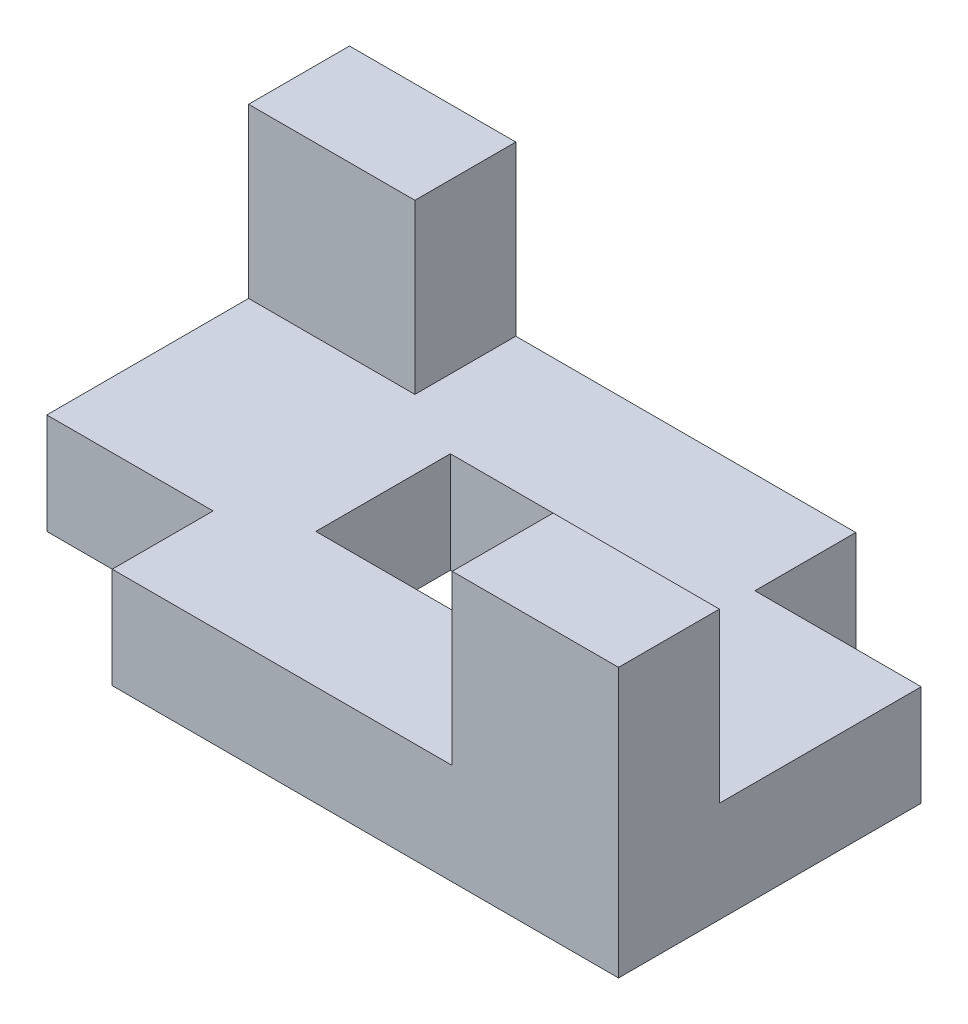
ISO-10303-21;
HEADER;
FILE_DESCRIPTION(('STEP AP214'),'2;1');
FILE_NAME('part.step','',(''),(''),'','','');
FILE_SCHEMA(('AUTOMOTIVE_DESIGN { 1 0 10303 214 1 1 1 1 }'));
ENDSEC;
DATA;
#1=APPLICATION_CONTEXT('core data for automotive mechanical design processes');
#2=APPLICATION_PROTOCOL_DEFINITION('international standard','automotive_design',2000,#1);
#3=PRODUCT_CONTEXT('',#1,'mechanical');
#4=PRODUCT('Part','Part','',(#3));
#5=PRODUCT_RELATED_PRODUCT_CATEGORY('part','',(#4));
#6=PRODUCT_DEFINITION_FORMATION('','',#4);
#7=PRODUCT_DEFINITION_CONTEXT('part definition',#1,'design');
#8=PRODUCT_DEFINITION('design','',#6,#7);
#9=PRODUCT_DEFINITION_SHAPE('','',#8);
#10=(LENGTH_UNIT() NAMED_UNIT(*) SI_UNIT(.MILLI.,.METRE.));
#11=(NAMED_UNIT(*) PLANE_ANGLE_UNIT() SI_UNIT($,.RADIAN.));
#12=(NAMED_UNIT(*) SI_UNIT($,.STERADIAN.) SOLID_ANGLE_UNIT());
#13=UNCERTAINTY_MEASURE_WITH_UNIT(LENGTH_MEASURE(1.E-05),#10,'distance_accuracy_value','');
#14=(GEOMETRIC_REPRESENTATION_CONTEXT(3) GLOBAL_UNCERTAINTY_ASSIGNED_CONTEXT((#13)) GLOBAL_UNIT_ASSIGNED_CONTEXT((#10,
#11,#12)) REPRESENTATION_CONTEXT('',''));
#15=CARTESIAN_POINT('',(0.,0.,0.));
#16=DIRECTION('',(0.,0.,1.));
#17=DIRECTION('',(1.,0.,0.));
#18=AXIS2_PLACEMENT_3D('',#15,#16,#17);
#19=CARTESIAN_POINT('',(0.,15.,0.));
#20=DIRECTION('',(0.,1.,0.));
#21=DIRECTION('',(0.,0.,1.));
#22=AXIS2_PLACEMENT_3D('',#19,#20,#21);
#23=PLANE('',#22);
#24=DIRECTION('',(-1.,0.,0.));
#25=VECTOR('',#24,1.);
#26=CARTESIAN_POINT('',(0.,15.,15.));
#27=LINE('',#26,#25);
#28=CARTESIAN_POINT('',(-25.27352297593,15.,15.));
#29=VERTEX_POINT('',#28);
#30=CARTESIAN_POINT('',(-50.,15.,15.));
#31=VERTEX_POINT('',#30);
#32=EDGE_CURVE('E260',#29,#31,#27,.T.);
#33=ORIENTED_EDGE('',*,*,#32,.F.);
#34=DIRECTION('',(0.,0.,1.));
#35=VECTOR('',#34,1.);
#36=CARTESIAN_POINT('',(-25.27352297593,15.,0.));
#37=LINE('',#36,#35);
#38=CARTESIAN_POINT('',(-25.27352297593,15.,30.));
#39=VERTEX_POINT('',#38);
#40=EDGE_CURVE('E263',#29,#39,#37,.T.);
#41=ORIENTED_EDGE('',*,*,#40,.T.);
#42=DIRECTION('',(1.,0.,0.));
#43=VECTOR('',#42,1.);
#44=CARTESIAN_POINT('',(0.,15.,30.));
#45=LINE('',#44,#43);
#46=CARTESIAN_POINT('',(25.27352297593,15.,30.));
#47=VERTEX_POINT('',#46);
#48=EDGE_CURVE('E347',#39,#47,#45,.T.);
#49=ORIENTED_EDGE('',*,*,#48,.T.);
#50=DIRECTION('',(0.,0.,1.));
#51=VECTOR('',#50,1.);
#52=CARTESIAN_POINT('',(25.27352297593,15.,0.));
#53=LINE('',#52,#51);
#54=CARTESIAN_POINT('',(25.27352297593,15.,15.));
#55=VERTEX_POINT('',#54);
#56=EDGE_CURVE('E293',#55,#47,#53,.T.);
#57=ORIENTED_EDGE('',*,*,#56,.F.);
#58=DIRECTION('',(1.,0.,0.));
#59=VECTOR('',#58,1.);
#60=CARTESIAN_POINT('',(0.,15.,15.));
#61=LINE('',#60,#59);
#62=CARTESIAN_POINT('',(50.,15.,15.));
#63=VERTEX_POINT('',#62);
#64=EDGE_CURVE('E297',#55,#63,#61,.T.);
#65=ORIENTED_EDGE('',*,*,#64,.T.);
#66=DIRECTION('',(0.,0.,1.));
#67=VECTOR('',#66,1.);
#68=CARTESIAN_POINT('',(50.,15.,0.));
#69=LINE('',#68,#67);
#70=CARTESIAN_POINT('',(50.,15.,-15.));
#71=VERTEX_POINT('',#70);
#72=EDGE_CURVE('E335',#71,#63,#69,.T.);
#73=ORIENTED_EDGE('',*,*,#72,.F.);
#74=DIRECTION('',(1.,0.,0.));
#75=VECTOR('',#74,1.);
#76=CARTESIAN_POINT('',(0.,15.,-15.));
#77=LINE('',#76,#75);
#78=CARTESIAN_POINT('',(25.27352297593,15.,-15.));
#79=VERTEX_POINT('',#78);
#80=EDGE_CURVE('E237',#79,#71,#77,.T.);
#81=ORIENTED_EDGE('',*,*,#80,.F.);
#82=DIRECTION('',(0.,0.,-1.));
#83=VECTOR('',#82,1.);
#84=CARTESIAN_POINT('',(25.27352297593,15.,0.));
#85=LINE('',#84,#83);
#86=CARTESIAN_POINT('',(25.27352297593,15.,-30.));
#87=VERTEX_POINT('',#86);
#88=EDGE_CURVE('E256',#79,#87,#85,.T.);
#89=ORIENTED_EDGE('',*,*,#88,.T.);
#90=DIRECTION('',(1.,0.,0.));
#91=VECTOR('',#90,1.);
#92=CARTESIAN_POINT('',(0.,15.,-30.));
#93=LINE('',#92,#91);
#94=CARTESIAN_POINT('',(-25.27352297593,15.,-30.));
#95=VERTEX_POINT('',#94);
#96=EDGE_CURVE('E338',#95,#87,#93,.T.);
#97=ORIENTED_EDGE('',*,*,#96,.F.);
#98=DIRECTION('',(0.,0.,-1.));
#99=VECTOR('',#98,1.);
#100=CARTESIAN_POINT('',(-25.27352297593,15.,0.));
#101=LINE('',#100,#99);
#102=CARTESIAN_POINT('',(-25.27352297593,15.,-15.));
#103=VERTEX_POINT('',#102);
#104=EDGE_CURVE('E320',#103,#95,#101,.T.);
#105=ORIENTED_EDGE('',*,*,#104,.F.);
#106=DIRECTION('',(-1.,0.,0.));
#107=VECTOR('',#106,1.);
#108=CARTESIAN_POINT('',(0.,15.,-15.));
#109=LINE('',#108,#107);
#110=CARTESIAN_POINT('',(-50.,15.,-15.));
#111=VERTEX_POINT('',#110);
#112=EDGE_CURVE('E331',#103,#111,#109,.T.);
#113=ORIENTED_EDGE('',*,*,#112,.T.);
#114=DIRECTION('',(0.,0.,1.));
#115=VECTOR('',#114,1.);
#116=CARTESIAN_POINT('',(-50.,15.,0.));
#117=LINE('',#116,#115);
#118=EDGE_CURVE('E343',#111,#31,#117,.T.);
#119=ORIENTED_EDGE('',*,*,#118,.T.);
#120=EDGE_LOOP('',(#33,#41,#49,#57,#65,#73,#81,#89,#97,#105,#113,#119));
#121=FACE_BOUND('',#120,.T.);
#122=DIRECTION('',(-1.,0.,0.));
#123=VECTOR('',#122,1.);
#124=CARTESIAN_POINT('',(0.,15.,10.));
#125=LINE('',#124,#123);
#126=CARTESIAN_POINT('',(15.,15.,10.));
#127=VERTEX_POINT('',#126);
#128=CARTESIAN_POINT('',(-15.,15.,10.));
#129=VERTEX_POINT('',#128);
#130=EDGE_CURVE('E212',#127,#129,#125,.T.);
#131=ORIENTED_EDGE('',*,*,#130,.T.);
#132=DIRECTION('',(0.,0.,-1.));
#133=VECTOR('',#132,1.);
#134=CARTESIAN_POINT('',(-15.,15.,0.));
#135=LINE('',#134,#133);
#136=CARTESIAN_POINT('',(-15.,15.,-10.));
#137=VERTEX_POINT('',#136);
#138=EDGE_CURVE('E173',#129,#137,#135,.T.);
#139=ORIENTED_EDGE('',*,*,#138,.T.);
#140=DIRECTION('',(-1.,0.,0.));
#141=VECTOR('',#140,1.);
#142=CARTESIAN_POINT('',(0.,15.,-10.));
#143=LINE('',#142,#141);
#144=CARTESIAN_POINT('',(15.,15.,-10.));
#145=VERTEX_POINT('',#144);
#146=EDGE_CURVE('E177',#145,#137,#143,.T.);
#147=ORIENTED_EDGE('',*,*,#146,.F.);
#148=DIRECTION('',(0.,0.,-1.));
#149=VECTOR('',#148,1.);
#150=CARTESIAN_POINT('',(15.,15.,0.));
#151=LINE('',#150,#149);
#152=EDGE_CURVE('E209',#127,#145,#151,.T.);
#153=ORIENTED_EDGE('',*,*,#152,.F.);
#154=EDGE_LOOP('',(#131,#139,#147,#153));
#155=FACE_BOUND('',#154,.T.);
#156=ADVANCED_FACE('F45',(#121,#155),#23,.T.);
#157=CARTESIAN_POINT('',(0.,0.,0.));
#158=DIRECTION('',(0.,1.,0.));
#159=DIRECTION('',(0.,0.,1.));
#160=AXIS2_PLACEMENT_3D('',#157,#158,#159);
#161=PLANE('',#160);
#162=DIRECTION('',(0.,0.,-1.));
#163=VECTOR('',#162,1.);
#164=CARTESIAN_POINT('',(-25.27352297593,0.,0.));
#165=LINE('',#164,#163);
#166=CARTESIAN_POINT('',(-25.27352297593,0.,30.));
#167=VERTEX_POINT('',#166);
#168=CARTESIAN_POINT('',(-25.27352297593,0.,15.));
#169=VERTEX_POINT('',#168);
#170=EDGE_CURVE('E218',#167,#169,#165,.T.);
#171=ORIENTED_EDGE('',*,*,#170,.T.);
#172=DIRECTION('',(1.,0.,0.));
#173=VECTOR('',#172,1.);
#174=CARTESIAN_POINT('',(0.,0.,15.));
#175=LINE('',#174,#173);
#176=CARTESIAN_POINT('',(-50.,0.,15.));
#177=VERTEX_POINT('',#176);
#178=EDGE_CURVE('E222',#177,#169,#175,.T.);
#179=ORIENTED_EDGE('',*,*,#178,.F.);
#180=DIRECTION('',(0.,0.,1.));
#181=VECTOR('',#180,1.);
#182=CARTESIAN_POINT('',(-50.,0.,0.));
#183=LINE('',#182,#181);
#184=CARTESIAN_POINT('',(-50.,0.,-30.));
#185=VERTEX_POINT('',#184);
#186=EDGE_CURVE('E357',#185,#177,#183,.T.);
#187=ORIENTED_EDGE('',*,*,#186,.F.);
#188=DIRECTION('',(1.,0.,0.));
#189=VECTOR('',#188,1.);
#190=CARTESIAN_POINT('',(0.,0.,-30.));
#191=LINE('',#190,#189);
#192=CARTESIAN_POINT('',(25.27352297593,0.,-30.));
#193=VERTEX_POINT('',#192);
#194=EDGE_CURVE('E353',#185,#193,#191,.T.);
#195=ORIENTED_EDGE('',*,*,#194,.T.);
#196=DIRECTION('',(0.,0.,1.));
#197=VECTOR('',#196,1.);
#198=CARTESIAN_POINT('',(25.27352297593,0.,0.));
#199=LINE('',#198,#197);
#200=CARTESIAN_POINT('',(25.27352297593,0.,-15.));
#201=VERTEX_POINT('',#200);
#202=EDGE_CURVE('E217',#193,#201,#199,.T.);
#203=ORIENTED_EDGE('',*,*,#202,.T.);
#204=DIRECTION('',(-1.,0.,0.));
#205=VECTOR('',#204,1.);
#206=CARTESIAN_POINT('',(0.,0.,-15.));
#207=LINE('',#206,#205);
#208=CARTESIAN_POINT('',(50.,0.,-15.));
#209=VERTEX_POINT('',#208);
#210=EDGE_CURVE('E241',#209,#201,#207,.T.);
#211=ORIENTED_EDGE('',*,*,#210,.F.);
#212=DIRECTION('',(0.,0.,1.));
#213=VECTOR('',#212,1.);
#214=CARTESIAN_POINT('',(50.,0.,0.));
#215=LINE('',#214,#213);
#216=CARTESIAN_POINT('',(50.,0.,30.));
#217=VERTEX_POINT('',#216);
#218=EDGE_CURVE('E334',#209,#217,#215,.T.);
#219=ORIENTED_EDGE('',*,*,#218,.T.);
#220=DIRECTION('',(1.,0.,0.));
#221=VECTOR('',#220,1.);
#222=CARTESIAN_POINT('',(0.,0.,30.));
#223=LINE('',#222,#221);
#224=EDGE_CURVE('E339',#167,#217,#223,.T.);
#225=ORIENTED_EDGE('',*,*,#224,.F.);
#226=EDGE_LOOP('',(#171,#179,#187,#195,#203,#211,#219,#225));
#227=FACE_BOUND('',#226,.T.);
#228=DIRECTION('',(0.,0.,1.));
#229=VECTOR('',#228,1.);
#230=CARTESIAN_POINT('',(-15.,0.,-10.));
#231=LINE('',#230,#229);
#232=CARTESIAN_POINT('',(-15.,0.,-10.));
#233=VERTEX_POINT('',#232);
#234=CARTESIAN_POINT('',(-15.,0.,10.));
#235=VERTEX_POINT('',#234);
#236=EDGE_CURVE('E69',#233,#235,#231,.T.);
#237=ORIENTED_EDGE('',*,*,#236,.T.);
#238=DIRECTION('',(1.,0.,0.));
#239=VECTOR('',#238,1.);
#240=CARTESIAN_POINT('',(-15.,0.,10.));
#241=LINE('',#240,#239);
#242=CARTESIAN_POINT('',(15.,0.,10.));
#243=VERTEX_POINT('',#242);
#244=EDGE_CURVE('E181',#235,#243,#241,.T.);
#245=ORIENTED_EDGE('',*,*,#244,.T.);
#246=DIRECTION('',(0.,0.,1.));
#247=VECTOR('',#246,1.);
#248=CARTESIAN_POINT('',(15.,0.,-10.));
#249=LINE('',#248,#247);
#250=CARTESIAN_POINT('',(15.,0.,-10.));
#251=VERTEX_POINT('',#250);
#252=EDGE_CURVE('E188',#251,#243,#249,.T.);
#253=ORIENTED_EDGE('',*,*,#252,.F.);
#254=DIRECTION('',(1.,0.,0.));
#255=VECTOR('',#254,1.);
#256=CARTESIAN_POINT('',(-15.,0.,-10.));
#257=LINE('',#256,#255);
#258=EDGE_CURVE('E192',#233,#251,#257,.T.);
#259=ORIENTED_EDGE('',*,*,#258,.F.);
#260=EDGE_LOOP('',(#237,#245,#253,#259));
#261=FACE_BOUND('',#260,.T.);
#262=ADVANCED_FACE('F191',(#227,#261),#161,.F.);
#263=CARTESIAN_POINT('',(0.,15.,-30.));
#264=DIRECTION('',(0.,0.,-1.));
#265=DIRECTION('',(-1.,0.,0.));
#266=AXIS2_PLACEMENT_3D('',#263,#264,#265);
#267=PLANE('',#266);
#268=ORIENTED_EDGE('',*,*,#96,.T.);
#269=DIRECTION('',(0.,-1.,0.));
#270=VECTOR('',#269,1.);
#271=CARTESIAN_POINT('',(25.27352297593,40.,-30.));
#272=LINE('',#271,#270);
#273=EDGE_CURVE('E223',#87,#193,#272,.T.);
#274=ORIENTED_EDGE('',*,*,#273,.T.);
#275=ORIENTED_EDGE('',*,*,#194,.F.);
#276=DIRECTION('',(0.,-1.,0.));
#277=VECTOR('',#276,1.);
#278=CARTESIAN_POINT('',(-50.,15.,-30.));
#279=LINE('',#278,#277);
#280=CARTESIAN_POINT('',(-50.,40.,-30.));
#281=VERTEX_POINT('',#280);
#282=EDGE_CURVE('E11',#281,#185,#279,.T.);
#283=ORIENTED_EDGE('',*,*,#282,.F.);
#284=DIRECTION('',(1.,0.,0.));
#285=VECTOR('',#284,1.);
#286=CARTESIAN_POINT('',(-50.,40.,-30.));
#287=LINE('',#286,#285);
#288=CARTESIAN_POINT('',(-25.27352297593,40.,-30.));
#289=VERTEX_POINT('',#288);
#290=EDGE_CURVE('E301',#281,#289,#287,.T.);
#291=ORIENTED_EDGE('',*,*,#290,.T.);
#292=DIRECTION('',(0.,-1.,0.));
#293=VECTOR('',#292,1.);
#294=CARTESIAN_POINT('',(-25.27352297593,40.,-30.));
#295=LINE('',#294,#293);
#296=EDGE_CURVE('E315',#289,#95,#295,.T.);
#297=ORIENTED_EDGE('',*,*,#296,.T.);
#298=EDGE_LOOP('',(#268,#274,#275,#283,#291,#297));
#299=FACE_BOUND('',#298,.T.);
#300=ADVANCED_FACE('F410',(#299),#267,.T.);
#301=CARTESIAN_POINT('',(0.,15.,30.));
#302=DIRECTION('',(0.,0.,-1.));
#303=DIRECTION('',(-1.,0.,0.));
#304=AXIS2_PLACEMENT_3D('',#301,#302,#303);
#305=PLANE('',#304);
#306=DIRECTION('',(0.,-1.,0.));
#307=VECTOR('',#306,1.);
#308=CARTESIAN_POINT('',(-25.27352297593,40.,30.));
#309=LINE('',#308,#307);
#310=EDGE_CURVE('E233',#39,#167,#309,.T.);
#311=ORIENTED_EDGE('',*,*,#310,.T.);
#312=ORIENTED_EDGE('',*,*,#224,.T.);
#313=DIRECTION('',(0.,-1.,0.));
#314=VECTOR('',#313,1.);
#315=CARTESIAN_POINT('',(50.,15.,30.));
#316=LINE('',#315,#314);
#317=CARTESIAN_POINT('',(50.,40.,30.));
#318=VERTEX_POINT('',#317);
#319=EDGE_CURVE('E54',#318,#217,#316,.T.);
#320=ORIENTED_EDGE('',*,*,#319,.F.);
#321=DIRECTION('',(-1.,0.,0.));
#322=VECTOR('',#321,1.);
#323=CARTESIAN_POINT('',(50.,40.,30.));
#324=LINE('',#323,#322);
#325=CARTESIAN_POINT('',(25.27352297593,40.,30.));
#326=VERTEX_POINT('',#325);
#327=EDGE_CURVE('E289',#318,#326,#324,.T.);
#328=ORIENTED_EDGE('',*,*,#327,.T.);
#329=DIRECTION('',(0.,-1.,0.));
#330=VECTOR('',#329,1.);
#331=CARTESIAN_POINT('',(25.27352297593,40.,30.));
#332=LINE('',#331,#330);
#333=EDGE_CURVE('E268',#326,#47,#332,.T.);
#334=ORIENTED_EDGE('',*,*,#333,.T.);
#335=ORIENTED_EDGE('',*,*,#48,.F.);
#336=EDGE_LOOP('',(#311,#312,#320,#328,#334,#335));
#337=FACE_BOUND('',#336,.T.);
#338=ADVANCED_FACE('F371',(#337),#305,.F.);
#339=CARTESIAN_POINT('',(50.,15.,0.));
#340=DIRECTION('',(1.,0.,0.));
#341=DIRECTION('',(0.,0.,-1.));
#342=AXIS2_PLACEMENT_3D('',#339,#340,#341);
#343=PLANE('',#342);
#344=DIRECTION('',(0.,-1.,0.));
#345=VECTOR('',#344,1.);
#346=CARTESIAN_POINT('',(50.,40.,-15.));
#347=LINE('',#346,#345);
#348=EDGE_CURVE('E245',#71,#209,#347,.T.);
#349=ORIENTED_EDGE('',*,*,#348,.F.);
#350=ORIENTED_EDGE('',*,*,#72,.T.);
#351=DIRECTION('',(0.,-1.,0.));
#352=VECTOR('',#351,1.);
#353=CARTESIAN_POINT('',(50.,40.,15.));
#354=LINE('',#353,#352);
#355=CARTESIAN_POINT('',(50.,40.,15.));
#356=VERTEX_POINT('',#355);
#357=EDGE_CURVE('E267',#356,#63,#354,.T.);
#358=ORIENTED_EDGE('',*,*,#357,.F.);
#359=DIRECTION('',(0.,0.,-1.));
#360=VECTOR('',#359,1.);
#361=CARTESIAN_POINT('',(50.,40.,30.));
#362=LINE('',#361,#360);
#363=EDGE_CURVE('E272',#318,#356,#362,.T.);
#364=ORIENTED_EDGE('',*,*,#363,.F.);
#365=ORIENTED_EDGE('',*,*,#319,.T.);
#366=ORIENTED_EDGE('',*,*,#218,.F.);
#367=EDGE_LOOP('',(#349,#350,#358,#364,#365,#366));
#368=FACE_BOUND('',#367,.T.);
#369=ADVANCED_FACE('F47',(#368),#343,.T.);
#370=CARTESIAN_POINT('',(-50.,15.,0.));
#371=DIRECTION('',(1.,0.,0.));
#372=DIRECTION('',(0.,0.,-1.));
#373=AXIS2_PLACEMENT_3D('',#370,#371,#372);
#374=PLANE('',#373);
#375=ORIENTED_EDGE('',*,*,#186,.T.);
#376=DIRECTION('',(0.,-1.,0.));
#377=VECTOR('',#376,1.);
#378=CARTESIAN_POINT('',(-50.,40.,15.));
#379=LINE('',#378,#377);
#380=EDGE_CURVE('E227',#31,#177,#379,.T.);
#381=ORIENTED_EDGE('',*,*,#380,.F.);
#382=ORIENTED_EDGE('',*,*,#118,.F.);
#383=DIRECTION('',(0.,-1.,0.));
#384=VECTOR('',#383,1.);
#385=CARTESIAN_POINT('',(-50.,40.,-15.));
#386=LINE('',#385,#384);
#387=CARTESIAN_POINT('',(-50.,40.,-15.));
#388=VERTEX_POINT('',#387);
#389=EDGE_CURVE('E316',#388,#111,#386,.T.);
#390=ORIENTED_EDGE('',*,*,#389,.F.);
#391=DIRECTION('',(0.,0.,1.));
#392=VECTOR('',#391,1.);
#393=CARTESIAN_POINT('',(-50.,40.,-30.));
#394=LINE('',#393,#392);
#395=EDGE_CURVE('E312',#281,#388,#394,.T.);
#396=ORIENTED_EDGE('',*,*,#395,.F.);
#397=ORIENTED_EDGE('',*,*,#282,.T.);
#398=EDGE_LOOP('',(#375,#381,#382,#390,#396,#397));
#399=FACE_BOUND('',#398,.T.);
#400=ADVANCED_FACE('F404',(#399),#374,.F.);
#401=CARTESIAN_POINT('',(-50.,40.,-15.));
#402=DIRECTION('',(0.,0.,-1.));
#403=DIRECTION('',(-1.,0.,0.));
#404=AXIS2_PLACEMENT_3D('',#401,#402,#403);
#405=PLANE('',#404);
#406=ORIENTED_EDGE('',*,*,#112,.F.);
#407=DIRECTION('',(0.,-1.,0.));
#408=VECTOR('',#407,1.);
#409=CARTESIAN_POINT('',(-25.27352297593,40.,-15.));
#410=LINE('',#409,#408);
#411=CARTESIAN_POINT('',(-25.27352297593,40.,-15.));
#412=VERTEX_POINT('',#411);
#413=EDGE_CURVE('E321',#412,#103,#410,.T.);
#414=ORIENTED_EDGE('',*,*,#413,.F.);
#415=DIRECTION('',(1.,0.,0.));
#416=VECTOR('',#415,1.);
#417=CARTESIAN_POINT('',(-50.,40.,-15.));
#418=LINE('',#417,#416);
#419=EDGE_CURVE('E309',#388,#412,#418,.T.);
#420=ORIENTED_EDGE('',*,*,#419,.F.);
#421=ORIENTED_EDGE('',*,*,#389,.T.);
#422=EDGE_LOOP('',(#406,#414,#420,#421));
#423=FACE_BOUND('',#422,.T.);
#424=ADVANCED_FACE('F420',(#423),#405,.F.);
#425=CARTESIAN_POINT('',(-25.27352297593,40.,-30.));
#426=DIRECTION('',(1.,0.,0.));
#427=DIRECTION('',(0.,0.,-1.));
#428=AXIS2_PLACEMENT_3D('',#425,#426,#427);
#429=PLANE('',#428);
#430=ORIENTED_EDGE('',*,*,#413,.T.);
#431=ORIENTED_EDGE('',*,*,#104,.T.);
#432=ORIENTED_EDGE('',*,*,#296,.F.);
#433=DIRECTION('',(0.,0.,1.));
#434=VECTOR('',#433,1.);
#435=CARTESIAN_POINT('',(-25.27352297593,40.,-30.));
#436=LINE('',#435,#434);
#437=EDGE_CURVE('E305',#289,#412,#436,.T.);
#438=ORIENTED_EDGE('',*,*,#437,.T.);
#439=EDGE_LOOP('',(#430,#431,#432,#438));
#440=FACE_BOUND('',#439,.T.);
#441=ADVANCED_FACE('F415',(#440),#429,.T.);
#442=CARTESIAN_POINT('',(0.,40.,0.));
#443=DIRECTION('',(0.,-1.,0.));
#444=DIRECTION('',(0.,0.,-1.));
#445=AXIS2_PLACEMENT_3D('',#442,#443,#444);
#446=PLANE('',#445);
#447=ORIENTED_EDGE('',*,*,#290,.F.);
#448=ORIENTED_EDGE('',*,*,#395,.T.);
#449=ORIENTED_EDGE('',*,*,#419,.T.);
#450=ORIENTED_EDGE('',*,*,#437,.F.);
#451=EDGE_LOOP('',(#447,#448,#449,#450));
#452=FACE_BOUND('',#451,.T.);
#453=ADVANCED_FACE('F422',(#452),#446,.F.);
#454=CARTESIAN_POINT('',(50.,40.,15.));
#455=DIRECTION('',(0.,0.,1.));
#456=DIRECTION('',(1.,0.,0.));
#457=AXIS2_PLACEMENT_3D('',#454,#455,#456);
#458=PLANE('',#457);
#459=ORIENTED_EDGE('',*,*,#64,.F.);
#460=DIRECTION('',(0.,-1.,0.));
#461=VECTOR('',#460,1.);
#462=CARTESIAN_POINT('',(25.27352297593,40.,15.));
#463=LINE('',#462,#461);
#464=CARTESIAN_POINT('',(25.27352297593,40.,15.));
#465=VERTEX_POINT('',#464);
#466=EDGE_CURVE('E273',#465,#55,#463,.T.);
#467=ORIENTED_EDGE('',*,*,#466,.F.);
#468=DIRECTION('',(-1.,0.,0.));
#469=VECTOR('',#468,1.);
#470=CARTESIAN_POINT('',(50.,40.,15.));
#471=LINE('',#470,#469);
#472=EDGE_CURVE('E282',#356,#465,#471,.T.);
#473=ORIENTED_EDGE('',*,*,#472,.F.);
#474=ORIENTED_EDGE('',*,*,#357,.T.);
#475=EDGE_LOOP('',(#459,#467,#473,#474));
#476=FACE_BOUND('',#475,.T.);
#477=ADVANCED_FACE('F388',(#476),#458,.F.);
#478=CARTESIAN_POINT('',(25.27352297593,40.,30.));
#479=DIRECTION('',(-1.,0.,0.));
#480=DIRECTION('',(0.,0.,1.));
#481=AXIS2_PLACEMENT_3D('',#478,#479,#480);
#482=PLANE('',#481);
#483=ORIENTED_EDGE('',*,*,#466,.T.);
#484=ORIENTED_EDGE('',*,*,#56,.T.);
#485=ORIENTED_EDGE('',*,*,#333,.F.);
#486=DIRECTION('',(0.,0.,-1.));
#487=VECTOR('',#486,1.);
#488=CARTESIAN_POINT('',(25.27352297593,40.,30.));
#489=LINE('',#488,#487);
#490=EDGE_CURVE('E285',#326,#465,#489,.T.);
#491=ORIENTED_EDGE('',*,*,#490,.T.);
#492=EDGE_LOOP('',(#483,#484,#485,#491));
#493=FACE_BOUND('',#492,.T.);
#494=ADVANCED_FACE('F393',(#493),#482,.T.);
#495=CARTESIAN_POINT('',(0.,40.,0.));
#496=DIRECTION('',(0.,-1.,0.));
#497=DIRECTION('',(0.,0.,-1.));
#498=AXIS2_PLACEMENT_3D('',#495,#496,#497);
#499=PLANE('',#498);
#500=ORIENTED_EDGE('',*,*,#327,.F.);
#501=ORIENTED_EDGE('',*,*,#363,.T.);
#502=ORIENTED_EDGE('',*,*,#472,.T.);
#503=ORIENTED_EDGE('',*,*,#490,.F.);
#504=EDGE_LOOP('',(#500,#501,#502,#503));
#505=FACE_BOUND('',#504,.T.);
#506=ADVANCED_FACE('F391',(#505),#499,.F.);
#507=CARTESIAN_POINT('',(25.27352297593,40.,0.));
#508=DIRECTION('',(1.,0.,0.));
#509=DIRECTION('',(0.,0.,-1.));
#510=AXIS2_PLACEMENT_3D('',#507,#508,#509);
#511=PLANE('',#510);
#512=DIRECTION('',(0.,-1.,0.));
#513=VECTOR('',#512,1.);
#514=CARTESIAN_POINT('',(25.27352297593,40.,-15.));
#515=LINE('',#514,#513);
#516=EDGE_CURVE('E248',#79,#201,#515,.T.);
#517=ORIENTED_EDGE('',*,*,#516,.T.);
#518=ORIENTED_EDGE('',*,*,#202,.F.);
#519=ORIENTED_EDGE('',*,*,#273,.F.);
#520=ORIENTED_EDGE('',*,*,#88,.F.);
#521=EDGE_LOOP('',(#517,#518,#519,#520));
#522=FACE_BOUND('',#521,.T.);
#523=ADVANCED_FACE('F412',(#522),#511,.T.);
#524=CARTESIAN_POINT('',(0.,40.,-15.));
#525=DIRECTION('',(0.,0.,1.));
#526=DIRECTION('',(1.,0.,0.));
#527=AXIS2_PLACEMENT_3D('',#524,#525,#526);
#528=PLANE('',#527);
#529=ORIENTED_EDGE('',*,*,#80,.T.);
#530=ORIENTED_EDGE('',*,*,#348,.T.);
#531=ORIENTED_EDGE('',*,*,#210,.T.);
#532=ORIENTED_EDGE('',*,*,#516,.F.);
#533=EDGE_LOOP('',(#529,#530,#531,#532));
#534=FACE_BOUND('',#533,.T.);
#535=ADVANCED_FACE('F378',(#534),#528,.F.);
#536=CARTESIAN_POINT('',(-25.27352297593,40.,0.));
#537=DIRECTION('',(-1.,0.,0.));
#538=DIRECTION('',(0.,0.,1.));
#539=AXIS2_PLACEMENT_3D('',#536,#537,#538);
#540=PLANE('',#539);
#541=DIRECTION('',(0.,-1.,0.));
#542=VECTOR('',#541,1.);
#543=CARTESIAN_POINT('',(-25.27352297593,40.,15.));
#544=LINE('',#543,#542);
#545=EDGE_CURVE('E230',#29,#169,#544,.T.);
#546=ORIENTED_EDGE('',*,*,#545,.T.);
#547=ORIENTED_EDGE('',*,*,#170,.F.);
#548=ORIENTED_EDGE('',*,*,#310,.F.);
#549=ORIENTED_EDGE('',*,*,#40,.F.);
#550=EDGE_LOOP('',(#546,#547,#548,#549));
#551=FACE_BOUND('',#550,.T.);
#552=ADVANCED_FACE('F396',(#551),#540,.T.);
#553=CARTESIAN_POINT('',(0.,40.,15.));
#554=DIRECTION('',(0.,0.,-1.));
#555=DIRECTION('',(-1.,0.,0.));
#556=AXIS2_PLACEMENT_3D('',#553,#554,#555);
#557=PLANE('',#556);
#558=ORIENTED_EDGE('',*,*,#32,.T.);
#559=ORIENTED_EDGE('',*,*,#380,.T.);
#560=ORIENTED_EDGE('',*,*,#178,.T.);
#561=ORIENTED_EDGE('',*,*,#545,.F.);
#562=EDGE_LOOP('',(#558,#559,#560,#561));
#563=FACE_BOUND('',#562,.T.);
#564=ADVANCED_FACE('F398',(#563),#557,.F.);
#565=CARTESIAN_POINT('',(-15.,40.,-10.));
#566=DIRECTION('',(1.,0.,0.));
#567=DIRECTION('',(0.,0.,-1.));
#568=AXIS2_PLACEMENT_3D('',#565,#566,#567);
#569=PLANE('',#568);
#570=DIRECTION('',(0.,-1.,0.));
#571=VECTOR('',#570,1.);
#572=CARTESIAN_POINT('',(-15.,40.,10.));
#573=LINE('',#572,#571);
#574=EDGE_CURVE('E169',#129,#235,#573,.T.);
#575=ORIENTED_EDGE('',*,*,#574,.T.);
#576=ORIENTED_EDGE('',*,*,#236,.F.);
#577=DIRECTION('',(0.,-1.,0.));
#578=VECTOR('',#577,1.);
#579=CARTESIAN_POINT('',(-15.,40.,-10.));
#580=LINE('',#579,#578);
#581=EDGE_CURVE('E200',#137,#233,#580,.T.);
#582=ORIENTED_EDGE('',*,*,#581,.F.);
#583=ORIENTED_EDGE('',*,*,#138,.F.);
#584=EDGE_LOOP('',(#575,#576,#582,#583));
#585=FACE_BOUND('',#584,.T.);
#586=ADVANCED_FACE('F171',(#585),#569,.T.);
#587=CARTESIAN_POINT('',(-15.,40.,10.));
#588=DIRECTION('',(0.,0.,-1.));
#589=DIRECTION('',(-1.,0.,0.));
#590=AXIS2_PLACEMENT_3D('',#587,#588,#589);
#591=PLANE('',#590);
#592=DIRECTION('',(0.,-1.,0.));
#593=VECTOR('',#592,1.);
#594=CARTESIAN_POINT('',(15.,40.,10.));
#595=LINE('',#594,#593);
#596=EDGE_CURVE('E178',#127,#243,#595,.T.);
#597=ORIENTED_EDGE('',*,*,#596,.T.);
#598=ORIENTED_EDGE('',*,*,#244,.F.);
#599=ORIENTED_EDGE('',*,*,#574,.F.);
#600=ORIENTED_EDGE('',*,*,#130,.F.);
#601=EDGE_LOOP('',(#597,#598,#599,#600));
#602=FACE_BOUND('',#601,.T.);
#603=ADVANCED_FACE('F182',(#602),#591,.T.);
#604=CARTESIAN_POINT('',(15.,40.,-10.));
#605=DIRECTION('',(1.,0.,0.));
#606=DIRECTION('',(0.,0.,-1.));
#607=AXIS2_PLACEMENT_3D('',#604,#605,#606);
#608=PLANE('',#607);
#609=ORIENTED_EDGE('',*,*,#152,.T.);
#610=DIRECTION('',(0.,-1.,0.));
#611=VECTOR('',#610,1.);
#612=CARTESIAN_POINT('',(15.,40.,-10.));
#613=LINE('',#612,#611);
#614=EDGE_CURVE('E61',#145,#251,#613,.T.);
#615=ORIENTED_EDGE('',*,*,#614,.T.);
#616=ORIENTED_EDGE('',*,*,#252,.T.);
#617=ORIENTED_EDGE('',*,*,#596,.F.);
#618=EDGE_LOOP('',(#609,#615,#616,#617));
#619=FACE_BOUND('',#618,.T.);
#620=ADVANCED_FACE('F539',(#619),#608,.F.);
#621=CARTESIAN_POINT('',(-15.,40.,-10.));
#622=DIRECTION('',(0.,0.,-1.));
#623=DIRECTION('',(-1.,0.,0.));
#624=AXIS2_PLACEMENT_3D('',#621,#622,#623);
#625=PLANE('',#624);
#626=ORIENTED_EDGE('',*,*,#146,.T.);
#627=ORIENTED_EDGE('',*,*,#581,.T.);
#628=ORIENTED_EDGE('',*,*,#258,.T.);
#629=ORIENTED_EDGE('',*,*,#614,.F.);
#630=EDGE_LOOP('',(#626,#627,#628,#629));
#631=FACE_BOUND('',#630,.T.);
#632=ADVANCED_FACE('F546',(#631),#625,.F.);
#633=CLOSED_SHELL('',(#156,#262,#300,#338,#369,#400,#424,#441,#453,#477,#494,#506,#523,#535,
#552,#564,#586,#603,#620,#632));
#634=MANIFOLD_SOLID_BREP('B2',#633);
#635=ADVANCED_BREP_SHAPE_REPRESENTATION('',(#18,#634),#14);
#636=SHAPE_DEFINITION_REPRESENTATION(#9,#635);
ENDSEC;
END-ISO-10303-21;
